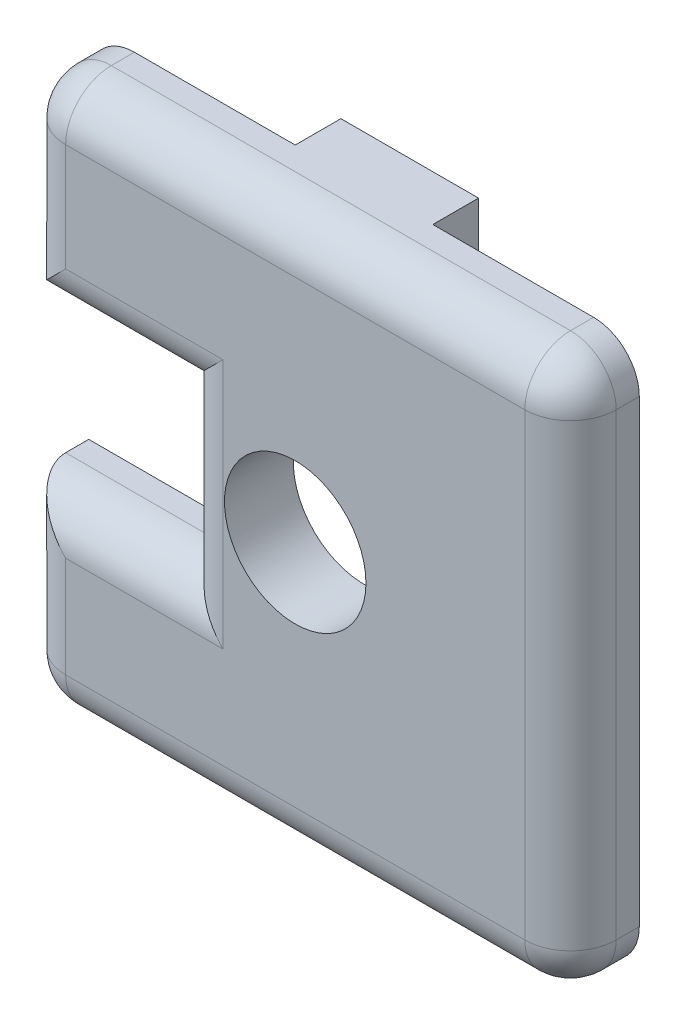
ISO-10303-21;
HEADER;
FILE_DESCRIPTION(('STEP AP214'),'2;1');
FILE_NAME('part.step','',(''),(''),'','','');
FILE_SCHEMA(('AUTOMOTIVE_DESIGN { 1 0 10303 214 1 1 1 1 }'));
ENDSEC;
DATA;
#1=APPLICATION_CONTEXT('core data for automotive mechanical design processes');
#2=APPLICATION_PROTOCOL_DEFINITION('international standard','automotive_design',2000,#1);
#3=PRODUCT_CONTEXT('',#1,'mechanical');
#4=PRODUCT('Part','Part','',(#3));
#5=PRODUCT_RELATED_PRODUCT_CATEGORY('part','',(#4));
#6=PRODUCT_DEFINITION_FORMATION('','',#4);
#7=PRODUCT_DEFINITION_CONTEXT('part definition',#1,'design');
#8=PRODUCT_DEFINITION('design','',#6,#7);
#9=PRODUCT_DEFINITION_SHAPE('','',#8);
#10=(LENGTH_UNIT() NAMED_UNIT(*) SI_UNIT(.MILLI.,.METRE.));
#11=(NAMED_UNIT(*) PLANE_ANGLE_UNIT() SI_UNIT($,.RADIAN.));
#12=(NAMED_UNIT(*) SI_UNIT($,.STERADIAN.) SOLID_ANGLE_UNIT());
#13=UNCERTAINTY_MEASURE_WITH_UNIT(LENGTH_MEASURE(1.E-05),#10,'distance_accuracy_value','');
#14=(GEOMETRIC_REPRESENTATION_CONTEXT(3) GLOBAL_UNCERTAINTY_ASSIGNED_CONTEXT((#13)) GLOBAL_UNIT_ASSIGNED_CONTEXT((#10,
#11,#12)) REPRESENTATION_CONTEXT('',''));
#15=CARTESIAN_POINT('',(0.,0.,0.));
#16=DIRECTION('',(0.,0.,1.));
#17=DIRECTION('',(1.,0.,0.));
#18=AXIS2_PLACEMENT_3D('',#15,#16,#17);
#19=CARTESIAN_POINT('',(-12.7,3.52080151197498,0.));
#20=DIRECTION('',(0.,0.,1.));
#21=DIRECTION('',(1.,0.,0.));
#22=AXIS2_PLACEMENT_3D('',#19,#20,#21);
#23=PLANE('',#22);
#24=CARTESIAN_POINT('',(0.,0.,0.));
#25=DIRECTION('',(0.,0.,1.));
#26=DIRECTION('',(1.,0.,0.));
#27=AXIS2_PLACEMENT_3D('',#24,#25,#26);
#28=CIRCLE('',#27,3.2639);
#29=CARTESIAN_POINT('',(3.2639,0.,0.));
#30=VERTEX_POINT('',#29);
#31=EDGE_CURVE('E196',#30,#30,#28,.F.);
#32=ORIENTED_EDGE('',*,*,#31,.F.);
#33=EDGE_LOOP('',(#32));
#34=FACE_BOUND('',#33,.T.);
#35=DIRECTION('',(0.,-1.,0.));
#36=VECTOR('',#35,1.);
#37=CARTESIAN_POINT('',(3.175,12.7,0.));
#38=LINE('',#37,#36);
#39=CARTESIAN_POINT('',(3.17499999999999,12.7,0.));
#40=VERTEX_POINT('',#39);
#41=CARTESIAN_POINT('',(3.175,10.5918,0.));
#42=VERTEX_POINT('',#41);
#43=EDGE_CURVE('E192',#40,#42,#38,.T.);
#44=ORIENTED_EDGE('',*,*,#43,.F.);
#45=DIRECTION('',(-1.,0.,0.));
#46=VECTOR('',#45,1.);
#47=CARTESIAN_POINT('',(-12.7,12.7,0.));
#48=LINE('',#47,#46);
#49=CARTESIAN_POINT('',(10.5918,12.7,0.));
#50=VERTEX_POINT('',#49);
#51=EDGE_CURVE('E234',#50,#40,#48,.T.);
#52=ORIENTED_EDGE('',*,*,#51,.F.);
#53=CARTESIAN_POINT('',(10.5918,10.5918,0.));
#54=DIRECTION('',(0.,0.,1.));
#55=DIRECTION('',(1.,0.,0.));
#56=AXIS2_PLACEMENT_3D('',#53,#54,#55);
#57=CIRCLE('',#56,2.1082);
#58=CARTESIAN_POINT('',(12.7,10.5918,0.));
#59=VERTEX_POINT('',#58);
#60=EDGE_CURVE('E282',#50,#59,#57,.F.);
#61=ORIENTED_EDGE('',*,*,#60,.T.);
#62=DIRECTION('',(0.,1.,0.));
#63=VECTOR('',#62,1.);
#64=CARTESIAN_POINT('',(12.7,12.7,0.));
#65=LINE('',#64,#63);
#66=CARTESIAN_POINT('',(12.7,-10.5918,0.));
#67=VERTEX_POINT('',#66);
#68=EDGE_CURVE('E223',#67,#59,#65,.T.);
#69=ORIENTED_EDGE('',*,*,#68,.F.);
#70=CARTESIAN_POINT('',(10.5918,-10.5918,0.));
#71=DIRECTION('',(0.,0.,1.));
#72=DIRECTION('',(1.,0.,0.));
#73=AXIS2_PLACEMENT_3D('',#70,#71,#72);
#74=CIRCLE('',#73,2.1082);
#75=CARTESIAN_POINT('',(10.5918,-12.7,0.));
#76=VERTEX_POINT('',#75);
#77=EDGE_CURVE('E42',#67,#76,#74,.F.);
#78=ORIENTED_EDGE('',*,*,#77,.T.);
#79=DIRECTION('',(1.,0.,0.));
#80=VECTOR('',#79,1.);
#81=CARTESIAN_POINT('',(-12.7,-12.7,0.));
#82=LINE('',#81,#80);
#83=CARTESIAN_POINT('',(-10.5918,-12.7,0.));
#84=VERTEX_POINT('',#83);
#85=EDGE_CURVE('E220',#84,#76,#82,.T.);
#86=ORIENTED_EDGE('',*,*,#85,.F.);
#87=CARTESIAN_POINT('',(-10.5918,-10.5918,0.));
#88=DIRECTION('',(0.,0.,1.));
#89=DIRECTION('',(1.,0.,0.));
#90=AXIS2_PLACEMENT_3D('',#87,#88,#89);
#91=CIRCLE('',#90,2.1082);
#92=CARTESIAN_POINT('',(-12.7,-10.5918,0.));
#93=VERTEX_POINT('',#92);
#94=EDGE_CURVE('E11',#84,#93,#91,.F.);
#95=ORIENTED_EDGE('',*,*,#94,.T.);
#96=DIRECTION('',(0.,-1.,0.));
#97=VECTOR('',#96,1.);
#98=CARTESIAN_POINT('',(-12.7,-3.82206925564077,0.));
#99=LINE('',#98,#97);
#100=CARTESIAN_POINT('',(-12.7,-3.82206925564077,0.));
#101=VERTEX_POINT('',#100);
#102=EDGE_CURVE('E217',#101,#93,#99,.T.);
#103=ORIENTED_EDGE('',*,*,#102,.F.);
#104=DIRECTION('',(-1.,0.,0.));
#105=VECTOR('',#104,1.);
#106=CARTESIAN_POINT('',(-12.7,-3.82206925564077,0.));
#107=LINE('',#106,#105);
#108=CARTESIAN_POINT('',(-5.44157637497733,-3.82206925564077,0.));
#109=VERTEX_POINT('',#108);
#110=EDGE_CURVE('E214',#109,#101,#107,.T.);
#111=ORIENTED_EDGE('',*,*,#110,.F.);
#112=DIRECTION('',(0.,-1.,0.));
#113=VECTOR('',#112,1.);
#114=CARTESIAN_POINT('',(-5.44157637497733,3.52080151197498,0.));
#115=LINE('',#114,#113);
#116=CARTESIAN_POINT('',(-5.44157637497733,3.52080151197498,0.));
#117=VERTEX_POINT('',#116);
#118=EDGE_CURVE('E211',#117,#109,#115,.T.);
#119=ORIENTED_EDGE('',*,*,#118,.F.);
#120=DIRECTION('',(1.,0.,0.));
#121=VECTOR('',#120,1.);
#122=CARTESIAN_POINT('',(-12.7,3.52080151197498,0.));
#123=LINE('',#122,#121);
#124=CARTESIAN_POINT('',(-12.7,3.52080151197498,0.));
#125=VERTEX_POINT('',#124);
#126=EDGE_CURVE('E207',#125,#117,#123,.T.);
#127=ORIENTED_EDGE('',*,*,#126,.F.);
#128=DIRECTION('',(0.,-1.,0.));
#129=VECTOR('',#128,1.);
#130=CARTESIAN_POINT('',(-12.7,12.7,0.));
#131=LINE('',#130,#129);
#132=CARTESIAN_POINT('',(-12.7,10.5918,0.));
#133=VERTEX_POINT('',#132);
#134=EDGE_CURVE('E205',#133,#125,#131,.T.);
#135=ORIENTED_EDGE('',*,*,#134,.F.);
#136=CARTESIAN_POINT('',(-10.5918,10.5918,0.));
#137=DIRECTION('',(0.,0.,1.));
#138=DIRECTION('',(1.,0.,0.));
#139=AXIS2_PLACEMENT_3D('',#136,#137,#138);
#140=CIRCLE('',#139,2.1082);
#141=CARTESIAN_POINT('',(-10.5918,12.7,0.));
#142=VERTEX_POINT('',#141);
#143=EDGE_CURVE('E284',#133,#142,#140,.F.);
#144=ORIENTED_EDGE('',*,*,#143,.T.);
#145=CARTESIAN_POINT('',(-3.17500000000001,12.7,0.));
#146=VERTEX_POINT('',#145);
#147=EDGE_CURVE('E56',#146,#142,#48,.T.);
#148=ORIENTED_EDGE('',*,*,#147,.F.);
#149=DIRECTION('',(0.,1.,0.));
#150=VECTOR('',#149,1.);
#151=CARTESIAN_POINT('',(-3.175,12.7,0.));
#152=LINE('',#151,#150);
#153=CARTESIAN_POINT('',(-3.175,10.5918,0.));
#154=VERTEX_POINT('',#153);
#155=EDGE_CURVE('E189',#154,#146,#152,.T.);
#156=ORIENTED_EDGE('',*,*,#155,.F.);
#157=DIRECTION('',(-1.,0.,0.));
#158=VECTOR('',#157,1.);
#159=CARTESIAN_POINT('',(3.175,10.5918,0.));
#160=LINE('',#159,#158);
#161=EDGE_CURVE('E50',#42,#154,#160,.T.);
#162=ORIENTED_EDGE('',*,*,#161,.F.);
#163=EDGE_LOOP('',(#44,#52,#61,#69,#78,#86,#95,#103,#111,#119,#127,#135,#144,#148,#156,#162));
#164=FACE_BOUND('',#163,.T.);
#165=ADVANCED_FACE('F33',(#34,#164),#23,.F.);
#166=CARTESIAN_POINT('',(-12.7,12.7,3.175));
#167=DIRECTION('',(1.,0.,0.));
#168=DIRECTION('',(0.,1.,0.));
#169=AXIS2_PLACEMENT_3D('',#166,#167,#168);
#170=PLANE('',#169);
#171=DIRECTION('',(0.,0.,-1.));
#172=VECTOR('',#171,1.);
#173=CARTESIAN_POINT('',(-12.7,3.52080151197498,3.175));
#174=LINE('',#173,#172);
#175=CARTESIAN_POINT('',(-12.7,3.52080151197498,1.0668));
#176=VERTEX_POINT('',#175);
#177=EDGE_CURVE('E336',#176,#125,#174,.T.);
#178=ORIENTED_EDGE('',*,*,#177,.F.);
#179=DIRECTION('',(0.,-1.,0.));
#180=VECTOR('',#179,1.);
#181=CARTESIAN_POINT('',(-12.7,12.7,1.0668));
#182=LINE('',#181,#180);
#183=CARTESIAN_POINT('',(-12.7,10.5918,1.0668));
#184=VERTEX_POINT('',#183);
#185=EDGE_CURVE('E286',#176,#184,#182,.F.);
#186=ORIENTED_EDGE('',*,*,#185,.T.);
#187=DIRECTION('',(0.,0.,-1.));
#188=VECTOR('',#187,1.);
#189=CARTESIAN_POINT('',(-12.7,10.5918,3.175));
#190=LINE('',#189,#188);
#191=EDGE_CURVE('E288',#184,#133,#190,.T.);
#192=ORIENTED_EDGE('',*,*,#191,.T.);
#193=ORIENTED_EDGE('',*,*,#134,.T.);
#194=EDGE_LOOP('',(#178,#186,#192,#193));
#195=FACE_BOUND('',#194,.T.);
#196=ADVANCED_FACE('F382',(#195),#170,.F.);
#197=CARTESIAN_POINT('',(-12.7,3.52080151197498,3.175));
#198=DIRECTION('',(0.,1.,0.));
#199=DIRECTION('',(0.,0.,1.));
#200=AXIS2_PLACEMENT_3D('',#197,#198,#199);
#201=PLANE('',#200);
#202=DIRECTION('',(0.,0.,-1.));
#203=VECTOR('',#202,1.);
#204=CARTESIAN_POINT('',(-5.44157637497733,3.52080151197498,3.175));
#205=LINE('',#204,#203);
#206=CARTESIAN_POINT('',(-5.44157637497733,3.52080151197498,1.0668));
#207=VERTEX_POINT('',#206);
#208=EDGE_CURVE('E339',#207,#117,#205,.T.);
#209=ORIENTED_EDGE('',*,*,#208,.F.);
#210=DIRECTION('',(1.,0.,0.));
#211=VECTOR('',#210,1.);
#212=CARTESIAN_POINT('',(-12.7,3.52080151197498,1.0668));
#213=LINE('',#212,#211);
#214=EDGE_CURVE('E290',#207,#176,#213,.F.);
#215=ORIENTED_EDGE('',*,*,#214,.T.);
#216=ORIENTED_EDGE('',*,*,#177,.T.);
#217=ORIENTED_EDGE('',*,*,#126,.T.);
#218=EDGE_LOOP('',(#209,#215,#216,#217));
#219=FACE_BOUND('',#218,.T.);
#220=ADVANCED_FACE('F376',(#219),#201,.F.);
#221=CARTESIAN_POINT('',(-5.44157637497733,3.52080151197498,3.175));
#222=DIRECTION('',(1.,0.,0.));
#223=DIRECTION('',(0.,0.,-1.));
#224=AXIS2_PLACEMENT_3D('',#221,#222,#223);
#225=PLANE('',#224);
#226=DIRECTION('',(0.,0.,-1.));
#227=VECTOR('',#226,1.);
#228=CARTESIAN_POINT('',(-5.44157637497733,-3.82206925564077,3.175));
#229=LINE('',#228,#227);
#230=CARTESIAN_POINT('',(-5.44157637497733,-3.82206925564077,1.0668));
#231=VERTEX_POINT('',#230);
#232=EDGE_CURVE('E340',#231,#109,#229,.T.);
#233=ORIENTED_EDGE('',*,*,#232,.F.);
#234=DIRECTION('',(0.,-1.,0.));
#235=VECTOR('',#234,1.);
#236=CARTESIAN_POINT('',(-5.44157637497733,3.52080151197498,1.0668));
#237=LINE('',#236,#235);
#238=EDGE_CURVE('E292',#231,#207,#237,.F.);
#239=ORIENTED_EDGE('',*,*,#238,.T.);
#240=ORIENTED_EDGE('',*,*,#208,.T.);
#241=ORIENTED_EDGE('',*,*,#118,.T.);
#242=EDGE_LOOP('',(#233,#239,#240,#241));
#243=FACE_BOUND('',#242,.T.);
#244=ADVANCED_FACE('F370',(#243),#225,.F.);
#245=CARTESIAN_POINT('',(-12.7,-3.82206925564077,3.175));
#246=DIRECTION('',(0.,-1.,0.));
#247=DIRECTION('',(0.,0.,-1.));
#248=AXIS2_PLACEMENT_3D('',#245,#246,#247);
#249=PLANE('',#248);
#250=DIRECTION('',(0.,0.,-1.));
#251=VECTOR('',#250,1.);
#252=CARTESIAN_POINT('',(-12.7,-3.82206925564077,3.175));
#253=LINE('',#252,#251);
#254=CARTESIAN_POINT('',(-12.7,-3.82206925564077,1.0668));
#255=VERTEX_POINT('',#254);
#256=EDGE_CURVE('E228',#255,#101,#253,.T.);
#257=ORIENTED_EDGE('',*,*,#256,.F.);
#258=DIRECTION('',(-1.,0.,0.));
#259=VECTOR('',#258,1.);
#260=CARTESIAN_POINT('',(-5.44157637497733,-3.82206925564077,1.0668));
#261=LINE('',#260,#259);
#262=EDGE_CURVE('E294',#255,#231,#261,.F.);
#263=ORIENTED_EDGE('',*,*,#262,.T.);
#264=ORIENTED_EDGE('',*,*,#232,.T.);
#265=ORIENTED_EDGE('',*,*,#110,.T.);
#266=EDGE_LOOP('',(#257,#263,#264,#265));
#267=FACE_BOUND('',#266,.T.);
#268=ADVANCED_FACE('F351',(#267),#249,.F.);
#269=CARTESIAN_POINT('',(-12.7,-3.82206925564077,3.175));
#270=DIRECTION('',(1.,0.,0.));
#271=DIRECTION('',(0.,1.,0.));
#272=AXIS2_PLACEMENT_3D('',#269,#270,#271);
#273=PLANE('',#272);
#274=DIRECTION('',(0.,0.,-1.));
#275=VECTOR('',#274,1.);
#276=CARTESIAN_POINT('',(-12.7,-10.5918,3.175));
#277=LINE('',#276,#275);
#278=CARTESIAN_POINT('',(-12.7,-10.5918,1.0668));
#279=VERTEX_POINT('',#278);
#280=EDGE_CURVE('E298',#93,#279,#277,.F.);
#281=ORIENTED_EDGE('',*,*,#280,.T.);
#282=DIRECTION('',(0.,-1.,0.));
#283=VECTOR('',#282,1.);
#284=CARTESIAN_POINT('',(-12.7,-3.82206925564077,1.0668));
#285=LINE('',#284,#283);
#286=EDGE_CURVE('E296',#279,#255,#285,.F.);
#287=ORIENTED_EDGE('',*,*,#286,.T.);
#288=ORIENTED_EDGE('',*,*,#256,.T.);
#289=ORIENTED_EDGE('',*,*,#102,.T.);
#290=EDGE_LOOP('',(#281,#287,#288,#289));
#291=FACE_BOUND('',#290,.T.);
#292=ADVANCED_FACE('F345',(#291),#273,.F.);
#293=CARTESIAN_POINT('',(-12.7,-12.7,3.175));
#294=DIRECTION('',(0.,1.,0.));
#295=DIRECTION('',(0.,0.,1.));
#296=AXIS2_PLACEMENT_3D('',#293,#294,#295);
#297=PLANE('',#296);
#298=DIRECTION('',(1.,0.,0.));
#299=VECTOR('',#298,1.);
#300=CARTESIAN_POINT('',(-12.7,-12.7,1.0668));
#301=LINE('',#300,#299);
#302=CARTESIAN_POINT('',(10.5918,-12.7,1.0668));
#303=VERTEX_POINT('',#302);
#304=CARTESIAN_POINT('',(-10.5918,-12.7,1.0668));
#305=VERTEX_POINT('',#304);
#306=EDGE_CURVE('E302',#303,#305,#301,.F.);
#307=ORIENTED_EDGE('',*,*,#306,.T.);
#308=DIRECTION('',(0.,0.,-1.));
#309=VECTOR('',#308,1.);
#310=CARTESIAN_POINT('',(-10.5918,-12.7,3.175));
#311=LINE('',#310,#309);
#312=EDGE_CURVE('E300',#305,#84,#311,.T.);
#313=ORIENTED_EDGE('',*,*,#312,.T.);
#314=ORIENTED_EDGE('',*,*,#85,.T.);
#315=DIRECTION('',(0.,0.,-1.));
#316=VECTOR('',#315,1.);
#317=CARTESIAN_POINT('',(10.5918,-12.7,3.175));
#318=LINE('',#317,#316);
#319=EDGE_CURVE('E304',#76,#303,#318,.F.);
#320=ORIENTED_EDGE('',*,*,#319,.T.);
#321=EDGE_LOOP('',(#307,#313,#314,#320));
#322=FACE_BOUND('',#321,.T.);
#323=ADVANCED_FACE('F446',(#322),#297,.F.);
#324=CARTESIAN_POINT('',(12.7,12.7,3.175));
#325=DIRECTION('',(-1.,0.,0.));
#326=DIRECTION('',(0.,-1.,0.));
#327=AXIS2_PLACEMENT_3D('',#324,#325,#326);
#328=PLANE('',#327);
#329=DIRECTION('',(0.,1.,0.));
#330=VECTOR('',#329,1.);
#331=CARTESIAN_POINT('',(12.7,-12.7,1.0668));
#332=LINE('',#331,#330);
#333=CARTESIAN_POINT('',(12.7,10.5918,1.0668));
#334=VERTEX_POINT('',#333);
#335=CARTESIAN_POINT('',(12.7,-10.5918,1.0668));
#336=VERTEX_POINT('',#335);
#337=EDGE_CURVE('E308',#334,#336,#332,.F.);
#338=ORIENTED_EDGE('',*,*,#337,.T.);
#339=DIRECTION('',(0.,0.,-1.));
#340=VECTOR('',#339,1.);
#341=CARTESIAN_POINT('',(12.7,-10.5918,3.175));
#342=LINE('',#341,#340);
#343=EDGE_CURVE('E306',#336,#67,#342,.T.);
#344=ORIENTED_EDGE('',*,*,#343,.T.);
#345=ORIENTED_EDGE('',*,*,#68,.T.);
#346=DIRECTION('',(0.,0.,-1.));
#347=VECTOR('',#346,1.);
#348=CARTESIAN_POINT('',(12.7,10.5918,3.175));
#349=LINE('',#348,#347);
#350=EDGE_CURVE('E310',#59,#334,#349,.F.);
#351=ORIENTED_EDGE('',*,*,#350,.T.);
#352=EDGE_LOOP('',(#338,#344,#345,#351));
#353=FACE_BOUND('',#352,.T.);
#354=ADVANCED_FACE('F443',(#353),#328,.F.);
#355=CARTESIAN_POINT('',(-12.7,12.7,3.175));
#356=DIRECTION('',(0.,-1.,0.));
#357=DIRECTION('',(1.,0.,0.));
#358=AXIS2_PLACEMENT_3D('',#355,#356,#357);
#359=PLANE('',#358);
#360=DIRECTION('',(-1.,0.,0.));
#361=VECTOR('',#360,1.);
#362=CARTESIAN_POINT('',(12.7,12.7,1.0668));
#363=LINE('',#362,#361);
#364=CARTESIAN_POINT('',(-10.5918,12.7,1.0668));
#365=VERTEX_POINT('',#364);
#366=CARTESIAN_POINT('',(10.5918,12.7,1.0668));
#367=VERTEX_POINT('',#366);
#368=EDGE_CURVE('E314',#365,#367,#363,.F.);
#369=ORIENTED_EDGE('',*,*,#368,.T.);
#370=DIRECTION('',(0.,0.,-1.));
#371=VECTOR('',#370,1.);
#372=CARTESIAN_POINT('',(10.5918,12.7,3.175));
#373=LINE('',#372,#371);
#374=EDGE_CURVE('E312',#367,#50,#373,.T.);
#375=ORIENTED_EDGE('',*,*,#374,.T.);
#376=ORIENTED_EDGE('',*,*,#51,.T.);
#377=DIRECTION('',(0.,0.,1.));
#378=VECTOR('',#377,1.);
#379=CARTESIAN_POINT('',(3.175,12.7,-2.1082));
#380=LINE('',#379,#378);
#381=CARTESIAN_POINT('',(3.175,12.7,-2.1082));
#382=VERTEX_POINT('',#381);
#383=EDGE_CURVE('E411',#382,#40,#380,.T.);
#384=ORIENTED_EDGE('',*,*,#383,.F.);
#385=DIRECTION('',(1.,0.,0.));
#386=VECTOR('',#385,1.);
#387=CARTESIAN_POINT('',(3.175,12.7,-2.1082));
#388=LINE('',#387,#386);
#389=CARTESIAN_POINT('',(-3.175,12.7,-2.1082));
#390=VERTEX_POINT('',#389);
#391=EDGE_CURVE('E185',#390,#382,#388,.T.);
#392=ORIENTED_EDGE('',*,*,#391,.F.);
#393=DIRECTION('',(0.,0.,1.));
#394=VECTOR('',#393,1.);
#395=CARTESIAN_POINT('',(-3.175,12.7,-2.1082));
#396=LINE('',#395,#394);
#397=EDGE_CURVE('E198',#390,#146,#396,.T.);
#398=ORIENTED_EDGE('',*,*,#397,.T.);
#399=ORIENTED_EDGE('',*,*,#147,.T.);
#400=DIRECTION('',(0.,0.,-1.));
#401=VECTOR('',#400,1.);
#402=CARTESIAN_POINT('',(-10.5918,12.7,3.175));
#403=LINE('',#402,#401);
#404=EDGE_CURVE('E317',#142,#365,#403,.F.);
#405=ORIENTED_EDGE('',*,*,#404,.T.);
#406=EDGE_LOOP('',(#369,#375,#376,#384,#392,#398,#399,#405));
#407=FACE_BOUND('',#406,.T.);
#408=ADVANCED_FACE('F405',(#407),#359,.F.);
#409=CARTESIAN_POINT('',(-12.7,3.52080151197498,3.175));
#410=DIRECTION('',(0.,0.,1.));
#411=DIRECTION('',(1.,0.,0.));
#412=AXIS2_PLACEMENT_3D('',#409,#410,#411);
#413=PLANE('',#412);
#414=CARTESIAN_POINT('',(0.,0.,3.175));
#415=DIRECTION('',(0.,0.,1.));
#416=DIRECTION('',(1.,0.,0.));
#417=AXIS2_PLACEMENT_3D('',#414,#415,#416);
#418=CIRCLE('',#417,3.2639);
#419=CARTESIAN_POINT('',(3.2639,0.,3.175));
#420=VERTEX_POINT('',#419);
#421=EDGE_CURVE('E193',#420,#420,#418,.T.);
#422=ORIENTED_EDGE('',*,*,#421,.F.);
#423=EDGE_LOOP('',(#422));
#424=FACE_BOUND('',#423,.T.);
#425=DIRECTION('',(0.,1.,0.));
#426=VECTOR('',#425,1.);
#427=CARTESIAN_POINT('',(10.5918,12.7,3.175));
#428=LINE('',#427,#426);
#429=CARTESIAN_POINT('',(10.5918,-10.5918,3.175));
#430=VERTEX_POINT('',#429);
#431=CARTESIAN_POINT('',(10.5918,10.5918,3.175));
#432=VERTEX_POINT('',#431);
#433=EDGE_CURVE('E322',#430,#432,#428,.T.);
#434=ORIENTED_EDGE('',*,*,#433,.T.);
#435=DIRECTION('',(-1.,0.,0.));
#436=VECTOR('',#435,1.);
#437=CARTESIAN_POINT('',(-12.7,10.5918,3.175));
#438=LINE('',#437,#436);
#439=CARTESIAN_POINT('',(-10.5918,10.5918,3.175));
#440=VERTEX_POINT('',#439);
#441=EDGE_CURVE('E319',#432,#440,#438,.T.);
#442=ORIENTED_EDGE('',*,*,#441,.T.);
#443=DIRECTION('',(0.,-1.,0.));
#444=VECTOR('',#443,1.);
#445=CARTESIAN_POINT('',(-10.5918,3.52080151197498,3.175));
#446=LINE('',#445,#444);
#447=CARTESIAN_POINT('',(-10.5918,5.62900151197498,3.175));
#448=VERTEX_POINT('',#447);
#449=EDGE_CURVE('E334',#440,#448,#446,.T.);
#450=ORIENTED_EDGE('',*,*,#449,.T.);
#451=DIRECTION('',(1.,0.,0.));
#452=VECTOR('',#451,1.);
#453=CARTESIAN_POINT('',(-5.44157637497733,5.62900151197498,3.175));
#454=LINE('',#453,#452);
#455=CARTESIAN_POINT('',(-3.33337637497733,5.62900151197498,3.175));
#456=VERTEX_POINT('',#455);
#457=EDGE_CURVE('E332',#448,#456,#454,.T.);
#458=ORIENTED_EDGE('',*,*,#457,.T.);
#459=DIRECTION('',(0.,-1.,0.));
#460=VECTOR('',#459,1.);
#461=CARTESIAN_POINT('',(-3.33337637497733,-3.82206925564077,3.175));
#462=LINE('',#461,#460);
#463=CARTESIAN_POINT('',(-3.33337637497733,-5.93026925564077,3.175));
#464=VERTEX_POINT('',#463);
#465=EDGE_CURVE('E330',#456,#464,#462,.T.);
#466=ORIENTED_EDGE('',*,*,#465,.T.);
#467=DIRECTION('',(-1.,0.,0.));
#468=VECTOR('',#467,1.);
#469=CARTESIAN_POINT('',(-12.7,-5.93026925564077,3.175));
#470=LINE('',#469,#468);
#471=CARTESIAN_POINT('',(-10.5918,-5.93026925564077,3.175));
#472=VERTEX_POINT('',#471);
#473=EDGE_CURVE('E328',#464,#472,#470,.T.);
#474=ORIENTED_EDGE('',*,*,#473,.T.);
#475=DIRECTION('',(0.,-1.,0.));
#476=VECTOR('',#475,1.);
#477=CARTESIAN_POINT('',(-10.5918,-12.7,3.175));
#478=LINE('',#477,#476);
#479=CARTESIAN_POINT('',(-10.5918,-10.5918,3.175));
#480=VERTEX_POINT('',#479);
#481=EDGE_CURVE('E326',#472,#480,#478,.T.);
#482=ORIENTED_EDGE('',*,*,#481,.T.);
#483=DIRECTION('',(1.,0.,0.));
#484=VECTOR('',#483,1.);
#485=CARTESIAN_POINT('',(12.7,-10.5918,3.175));
#486=LINE('',#485,#484);
#487=EDGE_CURVE('E324',#480,#430,#486,.T.);
#488=ORIENTED_EDGE('',*,*,#487,.T.);
#489=EDGE_LOOP('',(#434,#442,#450,#458,#466,#474,#482,#488));
#490=FACE_BOUND('',#489,.T.);
#491=ADVANCED_FACE('F439',(#424,#490),#413,.T.);
#492=CARTESIAN_POINT('',(-10.5918,-10.5918,3.175));
#493=DIRECTION('',(0.,0.,-1.));
#494=DIRECTION('',(-1.,0.,0.));
#495=AXIS2_PLACEMENT_3D('',#492,#493,#494);
#496=CYLINDRICAL_SURFACE('',#495,2.1082);
#497=ORIENTED_EDGE('',*,*,#94,.F.);
#498=ORIENTED_EDGE('',*,*,#312,.F.);
#499=CARTESIAN_POINT('',(-10.5918,-10.5918,1.0668));
#500=DIRECTION('',(0.,0.,1.));
#501=DIRECTION('',(1.,0.,0.));
#502=AXIS2_PLACEMENT_3D('',#499,#500,#501);
#503=CIRCLE('',#502,2.1082);
#504=EDGE_CURVE('E208',#279,#305,#503,.T.);
#505=ORIENTED_EDGE('',*,*,#504,.F.);
#506=ORIENTED_EDGE('',*,*,#280,.F.);
#507=EDGE_LOOP('',(#497,#498,#505,#506));
#508=FACE_BOUND('',#507,.T.);
#509=ADVANCED_FACE('F35',(#508),#496,.T.);
#510=CARTESIAN_POINT('',(-10.5918,3.52080151197498,1.0668));
#511=DIRECTION('',(0.,1.,0.));
#512=DIRECTION('',(-1.,0.,0.));
#513=AXIS2_PLACEMENT_3D('',#510,#511,#512);
#514=CYLINDRICAL_SURFACE('',#513,2.1082);
#515=CARTESIAN_POINT('',(-10.5918,-5.93026925564077,1.0668));
#516=DIRECTION('',(0.707106781186548,0.707106781186547,0.));
#517=DIRECTION('',(0.707106781186547,-0.707106781186548,0.));
#518=AXIS2_PLACEMENT_3D('',#515,#516,#517);
#519=ELLIPSE('',#518,2.98144503219496,2.1082);
#520=EDGE_CURVE('E242',#255,#472,#519,.T.);
#521=ORIENTED_EDGE('',*,*,#520,.F.);
#522=ORIENTED_EDGE('',*,*,#286,.F.);
#523=CARTESIAN_POINT('',(-10.5918,-10.5918,1.0668));
#524=DIRECTION('',(0.,-1.,0.));
#525=DIRECTION('',(1.,0.,0.));
#526=AXIS2_PLACEMENT_3D('',#523,#524,#525);
#527=CIRCLE('',#526,2.1082);
#528=EDGE_CURVE('E239',#480,#279,#527,.T.);
#529=ORIENTED_EDGE('',*,*,#528,.F.);
#530=ORIENTED_EDGE('',*,*,#481,.F.);
#531=EDGE_LOOP('',(#521,#522,#529,#530));
#532=FACE_BOUND('',#531,.T.);
#533=ADVANCED_FACE('F360',(#532),#514,.T.);
#534=CARTESIAN_POINT('',(-10.5918,-10.5918,1.0668));
#535=DIRECTION('',(0.,0.,1.));
#536=DIRECTION('',(1.,0.,0.));
#537=AXIS2_PLACEMENT_3D('',#534,#535,#536);
#538=SPHERICAL_SURFACE('',#537,2.1082);
#539=ORIENTED_EDGE('',*,*,#528,.T.);
#540=ORIENTED_EDGE('',*,*,#504,.T.);
#541=CARTESIAN_POINT('',(-10.5918,-10.5918,1.0668));
#542=DIRECTION('',(-1.,0.,0.));
#543=DIRECTION('',(0.,0.,1.));
#544=AXIS2_PLACEMENT_3D('',#541,#542,#543);
#545=CIRCLE('',#544,2.1082);
#546=EDGE_CURVE('E245',#480,#305,#545,.F.);
#547=ORIENTED_EDGE('',*,*,#546,.F.);
#548=EDGE_LOOP('',(#539,#540,#547));
#549=FACE_BOUND('',#548,.T.);
#550=ADVANCED_FACE('F500',(#549),#538,.T.);
#551=CARTESIAN_POINT('',(-12.7,-5.93026925564077,1.0668));
#552=DIRECTION('',(1.,0.,0.));
#553=DIRECTION('',(0.,0.,-1.));
#554=AXIS2_PLACEMENT_3D('',#551,#552,#553);
#555=CYLINDRICAL_SURFACE('',#554,2.1082);
#556=ORIENTED_EDGE('',*,*,#520,.T.);
#557=ORIENTED_EDGE('',*,*,#473,.F.);
#558=CARTESIAN_POINT('',(-3.33337637497733,-5.93026925564077,1.0668));
#559=DIRECTION('',(0.707106781186547,0.707106781186547,0.));
#560=DIRECTION('',(0.707106781186547,-0.707106781186547,0.));
#561=AXIS2_PLACEMENT_3D('',#558,#559,#560);
#562=ELLIPSE('',#561,2.98144503219496,2.1082);
#563=EDGE_CURVE('E248',#231,#464,#562,.T.);
#564=ORIENTED_EDGE('',*,*,#563,.F.);
#565=ORIENTED_EDGE('',*,*,#262,.F.);
#566=EDGE_LOOP('',(#556,#557,#564,#565));
#567=FACE_BOUND('',#566,.T.);
#568=ADVANCED_FACE('F367',(#567),#555,.T.);
#569=CARTESIAN_POINT('',(10.5918,-10.5918,3.175));
#570=DIRECTION('',(0.,0.,-1.));
#571=DIRECTION('',(-1.,0.,0.));
#572=AXIS2_PLACEMENT_3D('',#569,#570,#571);
#573=CYLINDRICAL_SURFACE('',#572,2.1082);
#574=ORIENTED_EDGE('',*,*,#77,.F.);
#575=ORIENTED_EDGE('',*,*,#343,.F.);
#576=CARTESIAN_POINT('',(10.5918,-10.5918,1.0668));
#577=DIRECTION('',(0.,0.,1.));
#578=DIRECTION('',(1.,0.,0.));
#579=AXIS2_PLACEMENT_3D('',#576,#577,#578);
#580=CIRCLE('',#579,2.1082);
#581=EDGE_CURVE('E251',#303,#336,#580,.T.);
#582=ORIENTED_EDGE('',*,*,#581,.F.);
#583=ORIENTED_EDGE('',*,*,#319,.F.);
#584=EDGE_LOOP('',(#574,#575,#582,#583));
#585=FACE_BOUND('',#584,.T.);
#586=ADVANCED_FACE('F493',(#585),#573,.T.);
#587=CARTESIAN_POINT('',(-12.7,-10.5918,1.0668));
#588=DIRECTION('',(-1.,0.,0.));
#589=DIRECTION('',(0.,0.,1.));
#590=AXIS2_PLACEMENT_3D('',#587,#588,#589);
#591=CYLINDRICAL_SURFACE('',#590,2.1082);
#592=ORIENTED_EDGE('',*,*,#546,.T.);
#593=ORIENTED_EDGE('',*,*,#306,.F.);
#594=CARTESIAN_POINT('',(10.5918,-10.5918,1.0668));
#595=DIRECTION('',(1.,0.,0.));
#596=DIRECTION('',(0.,1.,0.));
#597=AXIS2_PLACEMENT_3D('',#594,#595,#596);
#598=CIRCLE('',#597,2.1082);
#599=EDGE_CURVE('E254',#430,#303,#598,.T.);
#600=ORIENTED_EDGE('',*,*,#599,.F.);
#601=ORIENTED_EDGE('',*,*,#487,.F.);
#602=EDGE_LOOP('',(#592,#593,#600,#601));
#603=FACE_BOUND('',#602,.T.);
#604=ADVANCED_FACE('F489',(#603),#591,.T.);
#605=CARTESIAN_POINT('',(-3.33337637497733,3.52080151197498,1.0668));
#606=DIRECTION('',(0.,1.,0.));
#607=DIRECTION('',(0.,0.,1.));
#608=AXIS2_PLACEMENT_3D('',#605,#606,#607);
#609=CYLINDRICAL_SURFACE('',#608,2.1082);
#610=ORIENTED_EDGE('',*,*,#563,.T.);
#611=ORIENTED_EDGE('',*,*,#465,.F.);
#612=CARTESIAN_POINT('',(-3.33337637497733,5.62900151197498,1.0668));
#613=DIRECTION('',(-0.707106781186547,0.707106781186547,0.));
#614=DIRECTION('',(0.707106781186547,0.707106781186547,0.));
#615=AXIS2_PLACEMENT_3D('',#612,#613,#614);
#616=ELLIPSE('',#615,2.98144503219496,2.1082);
#617=EDGE_CURVE('E257',#207,#456,#616,.T.);
#618=ORIENTED_EDGE('',*,*,#617,.F.);
#619=ORIENTED_EDGE('',*,*,#238,.F.);
#620=EDGE_LOOP('',(#610,#611,#618,#619));
#621=FACE_BOUND('',#620,.T.);
#622=ADVANCED_FACE('F485',(#621),#609,.T.);
#623=CARTESIAN_POINT('',(10.5918,-10.5918,1.0668));
#624=DIRECTION('',(0.,0.,1.));
#625=DIRECTION('',(1.,0.,0.));
#626=AXIS2_PLACEMENT_3D('',#623,#624,#625);
#627=SPHERICAL_SURFACE('',#626,2.1082);
#628=ORIENTED_EDGE('',*,*,#599,.T.);
#629=ORIENTED_EDGE('',*,*,#581,.T.);
#630=CARTESIAN_POINT('',(10.5918,-10.5918,1.0668));
#631=DIRECTION('',(0.,-1.,0.));
#632=DIRECTION('',(0.,0.,-1.));
#633=AXIS2_PLACEMENT_3D('',#630,#631,#632);
#634=CIRCLE('',#633,2.1082);
#635=EDGE_CURVE('E260',#430,#336,#634,.F.);
#636=ORIENTED_EDGE('',*,*,#635,.F.);
#637=EDGE_LOOP('',(#628,#629,#636));
#638=FACE_BOUND('',#637,.T.);
#639=ADVANCED_FACE('F482',(#638),#627,.T.);
#640=CARTESIAN_POINT('',(-12.7,5.62900151197498,1.0668));
#641=DIRECTION('',(-1.,0.,0.));
#642=DIRECTION('',(0.,0.,1.));
#643=AXIS2_PLACEMENT_3D('',#640,#641,#642);
#644=CYLINDRICAL_SURFACE('',#643,2.1082);
#645=ORIENTED_EDGE('',*,*,#617,.T.);
#646=ORIENTED_EDGE('',*,*,#457,.F.);
#647=CARTESIAN_POINT('',(-10.5918,5.62900151197498,1.0668));
#648=DIRECTION('',(-0.707106781186547,0.707106781186548,0.));
#649=DIRECTION('',(0.707106781186548,0.707106781186547,0.));
#650=AXIS2_PLACEMENT_3D('',#647,#648,#649);
#651=ELLIPSE('',#650,2.98144503219496,2.1082);
#652=EDGE_CURVE('E263',#176,#448,#651,.T.);
#653=ORIENTED_EDGE('',*,*,#652,.F.);
#654=ORIENTED_EDGE('',*,*,#214,.F.);
#655=EDGE_LOOP('',(#645,#646,#653,#654));
#656=FACE_BOUND('',#655,.T.);
#657=ADVANCED_FACE('F387',(#656),#644,.T.);
#658=CARTESIAN_POINT('',(10.5918,10.5918,3.175));
#659=DIRECTION('',(0.,0.,-1.));
#660=DIRECTION('',(-1.,0.,0.));
#661=AXIS2_PLACEMENT_3D('',#658,#659,#660);
#662=CYLINDRICAL_SURFACE('',#661,2.1082);
#663=ORIENTED_EDGE('',*,*,#60,.F.);
#664=ORIENTED_EDGE('',*,*,#374,.F.);
#665=CARTESIAN_POINT('',(10.5918,10.5918,1.0668));
#666=DIRECTION('',(0.,0.,1.));
#667=DIRECTION('',(1.,0.,0.));
#668=AXIS2_PLACEMENT_3D('',#665,#666,#667);
#669=CIRCLE('',#668,2.1082);
#670=EDGE_CURVE('E266',#334,#367,#669,.T.);
#671=ORIENTED_EDGE('',*,*,#670,.F.);
#672=ORIENTED_EDGE('',*,*,#350,.F.);
#673=EDGE_LOOP('',(#663,#664,#671,#672));
#674=FACE_BOUND('',#673,.T.);
#675=ADVANCED_FACE('F475',(#674),#662,.T.);
#676=CARTESIAN_POINT('',(10.5918,3.52080151197499,1.0668));
#677=DIRECTION('',(0.,-1.,0.));
#678=DIRECTION('',(1.,0.,0.));
#679=AXIS2_PLACEMENT_3D('',#676,#677,#678);
#680=CYLINDRICAL_SURFACE('',#679,2.1082);
#681=ORIENTED_EDGE('',*,*,#635,.T.);
#682=ORIENTED_EDGE('',*,*,#337,.F.);
#683=CARTESIAN_POINT('',(10.5918,10.5918,1.0668));
#684=DIRECTION('',(0.,1.,0.));
#685=DIRECTION('',(0.,0.,1.));
#686=AXIS2_PLACEMENT_3D('',#683,#684,#685);
#687=CIRCLE('',#686,2.1082);
#688=EDGE_CURVE('E269',#432,#334,#687,.T.);
#689=ORIENTED_EDGE('',*,*,#688,.F.);
#690=ORIENTED_EDGE('',*,*,#433,.F.);
#691=EDGE_LOOP('',(#681,#682,#689,#690));
#692=FACE_BOUND('',#691,.T.);
#693=ADVANCED_FACE('F472',(#692),#680,.T.);
#694=CARTESIAN_POINT('',(-10.5918,3.52080151197498,1.0668));
#695=DIRECTION('',(0.,1.,0.));
#696=DIRECTION('',(-1.,0.,0.));
#697=AXIS2_PLACEMENT_3D('',#694,#695,#696);
#698=CYLINDRICAL_SURFACE('',#697,2.1082);
#699=ORIENTED_EDGE('',*,*,#652,.T.);
#700=ORIENTED_EDGE('',*,*,#449,.F.);
#701=CARTESIAN_POINT('',(-10.5918,10.5918,1.0668));
#702=DIRECTION('',(0.,1.,0.));
#703=DIRECTION('',(0.,0.,1.));
#704=AXIS2_PLACEMENT_3D('',#701,#702,#703);
#705=CIRCLE('',#704,2.1082);
#706=EDGE_CURVE('E272',#184,#440,#705,.T.);
#707=ORIENTED_EDGE('',*,*,#706,.F.);
#708=ORIENTED_EDGE('',*,*,#185,.F.);
#709=EDGE_LOOP('',(#699,#700,#707,#708));
#710=FACE_BOUND('',#709,.T.);
#711=ADVANCED_FACE('F391',(#710),#698,.T.);
#712=CARTESIAN_POINT('',(-10.5918,10.5918,3.175));
#713=DIRECTION('',(0.,0.,-1.));
#714=DIRECTION('',(-1.,0.,0.));
#715=AXIS2_PLACEMENT_3D('',#712,#713,#714);
#716=CYLINDRICAL_SURFACE('',#715,2.1082);
#717=ORIENTED_EDGE('',*,*,#143,.F.);
#718=ORIENTED_EDGE('',*,*,#191,.F.);
#719=CARTESIAN_POINT('',(-10.5918,10.5918,1.0668));
#720=DIRECTION('',(0.,0.,1.));
#721=DIRECTION('',(1.,0.,0.));
#722=AXIS2_PLACEMENT_3D('',#719,#720,#721);
#723=CIRCLE('',#722,2.1082);
#724=EDGE_CURVE('E275',#365,#184,#723,.T.);
#725=ORIENTED_EDGE('',*,*,#724,.F.);
#726=ORIENTED_EDGE('',*,*,#404,.F.);
#727=EDGE_LOOP('',(#717,#718,#725,#726));
#728=FACE_BOUND('',#727,.T.);
#729=ADVANCED_FACE('F399',(#728),#716,.T.);
#730=CARTESIAN_POINT('',(10.5918,10.5918,1.0668));
#731=DIRECTION('',(0.,0.,1.));
#732=DIRECTION('',(1.,0.,0.));
#733=AXIS2_PLACEMENT_3D('',#730,#731,#732);
#734=SPHERICAL_SURFACE('',#733,2.1082);
#735=ORIENTED_EDGE('',*,*,#688,.T.);
#736=ORIENTED_EDGE('',*,*,#670,.T.);
#737=CARTESIAN_POINT('',(10.5918,10.5918,1.0668));
#738=DIRECTION('',(1.,0.,0.));
#739=DIRECTION('',(0.,0.,-1.));
#740=AXIS2_PLACEMENT_3D('',#737,#738,#739);
#741=CIRCLE('',#740,2.1082);
#742=EDGE_CURVE('E278',#432,#367,#741,.F.);
#743=ORIENTED_EDGE('',*,*,#742,.F.);
#744=EDGE_LOOP('',(#735,#736,#743));
#745=FACE_BOUND('',#744,.T.);
#746=ADVANCED_FACE('F464',(#745),#734,.T.);
#747=CARTESIAN_POINT('',(-10.5918,10.5918,1.0668));
#748=DIRECTION('',(0.,0.,1.));
#749=DIRECTION('',(1.,0.,0.));
#750=AXIS2_PLACEMENT_3D('',#747,#748,#749);
#751=SPHERICAL_SURFACE('',#750,2.1082);
#752=ORIENTED_EDGE('',*,*,#724,.T.);
#753=ORIENTED_EDGE('',*,*,#706,.T.);
#754=CARTESIAN_POINT('',(-10.5918,10.5918,1.0668));
#755=DIRECTION('',(-1.,0.,0.));
#756=DIRECTION('',(0.,0.,1.));
#757=AXIS2_PLACEMENT_3D('',#754,#755,#756);
#758=CIRCLE('',#757,2.1082);
#759=EDGE_CURVE('E204',#365,#440,#758,.F.);
#760=ORIENTED_EDGE('',*,*,#759,.F.);
#761=EDGE_LOOP('',(#752,#753,#760));
#762=FACE_BOUND('',#761,.T.);
#763=ADVANCED_FACE('F395',(#762),#751,.T.);
#764=CARTESIAN_POINT('',(-12.7,10.5918,1.0668));
#765=DIRECTION('',(1.,0.,0.));
#766=DIRECTION('',(0.,1.,0.));
#767=AXIS2_PLACEMENT_3D('',#764,#765,#766);
#768=CYLINDRICAL_SURFACE('',#767,2.1082);
#769=ORIENTED_EDGE('',*,*,#742,.T.);
#770=ORIENTED_EDGE('',*,*,#368,.F.);
#771=ORIENTED_EDGE('',*,*,#759,.T.);
#772=ORIENTED_EDGE('',*,*,#441,.F.);
#773=EDGE_LOOP('',(#769,#770,#771,#772));
#774=FACE_BOUND('',#773,.T.);
#775=ADVANCED_FACE('F401',(#774),#768,.T.);
#776=CARTESIAN_POINT('',(0.,0.,-0.00100000000000013));
#777=DIRECTION('',(0.,0.,1.));
#778=DIRECTION('',(1.,0.,0.));
#779=AXIS2_PLACEMENT_3D('',#776,#777,#778);
#780=CYLINDRICAL_SURFACE('',#779,3.2639);
#781=ORIENTED_EDGE('',*,*,#421,.T.);
#782=EDGE_LOOP('',(#781));
#783=FACE_BOUND('',#782,.T.);
#784=ORIENTED_EDGE('',*,*,#31,.T.);
#785=EDGE_LOOP('',(#784));
#786=FACE_BOUND('',#785,.T.);
#787=ADVANCED_FACE('F461',(#783,#786),#780,.F.);
#788=CARTESIAN_POINT('',(3.175,12.7,-2.1082));
#789=DIRECTION('',(-1.,0.,0.));
#790=DIRECTION('',(0.,0.,1.));
#791=AXIS2_PLACEMENT_3D('',#788,#789,#790);
#792=PLANE('',#791);
#793=ORIENTED_EDGE('',*,*,#43,.T.);
#794=DIRECTION('',(0.,0.,1.));
#795=VECTOR('',#794,1.);
#796=CARTESIAN_POINT('',(3.175,10.5918,-2.1082));
#797=LINE('',#796,#795);
#798=CARTESIAN_POINT('',(3.175,10.5918,-2.1082));
#799=VERTEX_POINT('',#798);
#800=EDGE_CURVE('E173',#799,#42,#797,.T.);
#801=ORIENTED_EDGE('',*,*,#800,.F.);
#802=DIRECTION('',(0.,-1.,0.));
#803=VECTOR('',#802,1.);
#804=CARTESIAN_POINT('',(3.175,12.7,-2.1082));
#805=LINE('',#804,#803);
#806=EDGE_CURVE('E180',#382,#799,#805,.T.);
#807=ORIENTED_EDGE('',*,*,#806,.F.);
#808=ORIENTED_EDGE('',*,*,#383,.T.);
#809=EDGE_LOOP('',(#793,#801,#807,#808));
#810=FACE_BOUND('',#809,.T.);
#811=ADVANCED_FACE('F191',(#810),#792,.F.);
#812=CARTESIAN_POINT('',(3.175,10.5918,-2.1082));
#813=DIRECTION('',(0.,1.,0.));
#814=DIRECTION('',(0.,0.,1.));
#815=AXIS2_PLACEMENT_3D('',#812,#813,#814);
#816=PLANE('',#815);
#817=ORIENTED_EDGE('',*,*,#161,.T.);
#818=DIRECTION('',(0.,0.,1.));
#819=VECTOR('',#818,1.);
#820=CARTESIAN_POINT('',(-3.175,10.5918,-2.1082));
#821=LINE('',#820,#819);
#822=CARTESIAN_POINT('',(-3.175,10.5918,-2.1082));
#823=VERTEX_POINT('',#822);
#824=EDGE_CURVE('E176',#823,#154,#821,.T.);
#825=ORIENTED_EDGE('',*,*,#824,.F.);
#826=DIRECTION('',(-1.,0.,0.));
#827=VECTOR('',#826,1.);
#828=CARTESIAN_POINT('',(3.175,10.5918,-2.1082));
#829=LINE('',#828,#827);
#830=EDGE_CURVE('E169',#799,#823,#829,.T.);
#831=ORIENTED_EDGE('',*,*,#830,.F.);
#832=ORIENTED_EDGE('',*,*,#800,.T.);
#833=EDGE_LOOP('',(#817,#825,#831,#832));
#834=FACE_BOUND('',#833,.T.);
#835=ADVANCED_FACE('F171',(#834),#816,.F.);
#836=CARTESIAN_POINT('',(-3.175,12.7,-2.1082));
#837=DIRECTION('',(1.,0.,0.));
#838=DIRECTION('',(0.,0.,-1.));
#839=AXIS2_PLACEMENT_3D('',#836,#837,#838);
#840=PLANE('',#839);
#841=ORIENTED_EDGE('',*,*,#155,.T.);
#842=ORIENTED_EDGE('',*,*,#397,.F.);
#843=DIRECTION('',(0.,1.,0.));
#844=VECTOR('',#843,1.);
#845=CARTESIAN_POINT('',(-3.175,12.7,-2.1082));
#846=LINE('',#845,#844);
#847=EDGE_CURVE('E179',#823,#390,#846,.T.);
#848=ORIENTED_EDGE('',*,*,#847,.F.);
#849=ORIENTED_EDGE('',*,*,#824,.T.);
#850=EDGE_LOOP('',(#841,#842,#848,#849));
#851=FACE_BOUND('',#850,.T.);
#852=ADVANCED_FACE('F420',(#851),#840,.F.);
#853=CARTESIAN_POINT('',(3.175,10.5918,-2.1082));
#854=DIRECTION('',(0.,0.,-1.));
#855=DIRECTION('',(-1.,0.,0.));
#856=AXIS2_PLACEMENT_3D('',#853,#854,#855);
#857=PLANE('',#856);
#858=ORIENTED_EDGE('',*,*,#806,.T.);
#859=ORIENTED_EDGE('',*,*,#830,.T.);
#860=ORIENTED_EDGE('',*,*,#847,.T.);
#861=ORIENTED_EDGE('',*,*,#391,.T.);
#862=EDGE_LOOP('',(#858,#859,#860,#861));
#863=FACE_BOUND('',#862,.T.);
#864=ADVANCED_FACE('F183',(#863),#857,.T.);
#865=CLOSED_SHELL('',(#165,#196,#220,#244,#268,#292,#323,#354,#408,#491,#509,#533,#550,#568,
#586,#604,#622,#639,#657,#675,#693,#711,#729,#746,#763,#775,#787,#811,#835,#852,#864));
#866=MANIFOLD_SOLID_BREP('B2',#865);
#867=ADVANCED_BREP_SHAPE_REPRESENTATION('',(#18,#866),#14);
#868=SHAPE_DEFINITION_REPRESENTATION(#9,#867);
ENDSEC;
END-ISO-10303-21;
